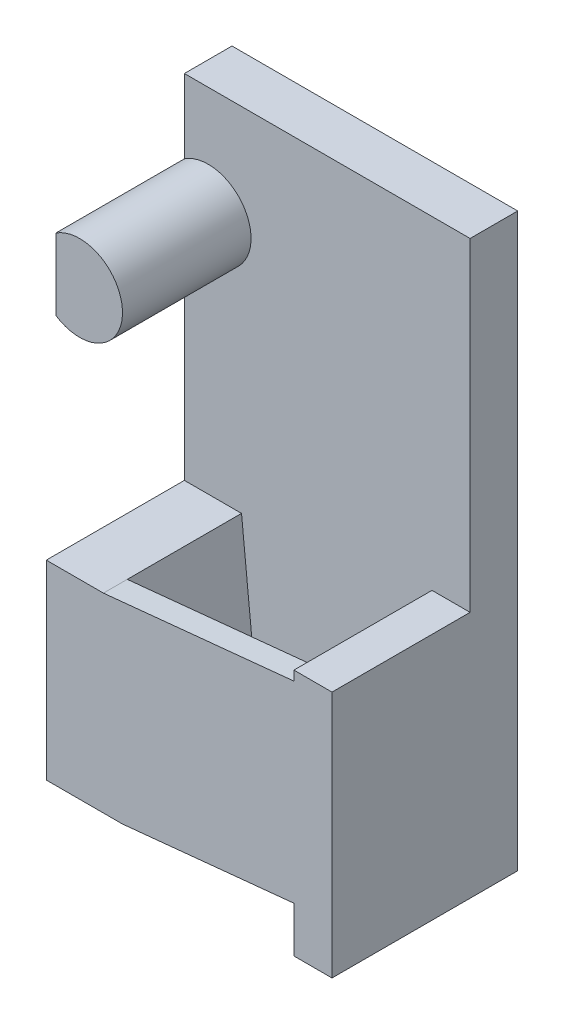
ISO-10303-21;
HEADER;
FILE_DESCRIPTION(('STEP AP214'),'2;1');
FILE_NAME('part.step','',(''),(''),'','','');
FILE_SCHEMA(('AUTOMOTIVE_DESIGN { 1 0 10303 214 1 1 1 1 }'));
ENDSEC;
DATA;
#1=APPLICATION_CONTEXT('core data for automotive mechanical design processes');
#2=APPLICATION_PROTOCOL_DEFINITION('international standard','automotive_design',2000,#1);
#3=PRODUCT_CONTEXT('',#1,'mechanical');
#4=PRODUCT('Part','Part','',(#3));
#5=PRODUCT_RELATED_PRODUCT_CATEGORY('part','',(#4));
#6=PRODUCT_DEFINITION_FORMATION('','',#4);
#7=PRODUCT_DEFINITION_CONTEXT('part definition',#1,'design');
#8=PRODUCT_DEFINITION('design','',#6,#7);
#9=PRODUCT_DEFINITION_SHAPE('','',#8);
#10=(LENGTH_UNIT() NAMED_UNIT(*) SI_UNIT(.MILLI.,.METRE.));
#11=(NAMED_UNIT(*) PLANE_ANGLE_UNIT() SI_UNIT($,.RADIAN.));
#12=(NAMED_UNIT(*) SI_UNIT($,.STERADIAN.) SOLID_ANGLE_UNIT());
#13=UNCERTAINTY_MEASURE_WITH_UNIT(LENGTH_MEASURE(1.E-05),#10,'distance_accuracy_value','');
#14=(GEOMETRIC_REPRESENTATION_CONTEXT(3) GLOBAL_UNCERTAINTY_ASSIGNED_CONTEXT((#13)) GLOBAL_UNIT_ASSIGNED_CONTEXT((#10,
#11,#12)) REPRESENTATION_CONTEXT('',''));
#15=CARTESIAN_POINT('',(0.,0.,0.));
#16=DIRECTION('',(0.,0.,1.));
#17=DIRECTION('',(1.,0.,0.));
#18=AXIS2_PLACEMENT_3D('',#15,#16,#17);
#19=CARTESIAN_POINT('',(52.,0.,39.));
#20=DIRECTION('',(1.,0.,0.));
#21=DIRECTION('',(0.,0.,-1.));
#22=AXIS2_PLACEMENT_3D('',#19,#20,#21);
#23=PLANE('',#22);
#24=DIRECTION('',(0.,0.,1.));
#25=VECTOR('',#24,1.);
#26=CARTESIAN_POINT('',(52.,9.6,39.));
#27=LINE('',#26,#25);
#28=CARTESIAN_POINT('',(52.,9.6,34.));
#29=VERTEX_POINT('',#28);
#30=CARTESIAN_POINT('',(52.,9.6,39.));
#31=VERTEX_POINT('',#30);
#32=EDGE_CURVE('E48',#29,#31,#27,.T.);
#33=ORIENTED_EDGE('',*,*,#32,.F.);
#34=DIRECTION('',(0.,-1.,0.));
#35=VECTOR('',#34,1.);
#36=CARTESIAN_POINT('',(52.,0.,34.));
#37=LINE('',#36,#35);
#38=CARTESIAN_POINT('',(52.,50.,34.));
#39=VERTEX_POINT('',#38);
#40=EDGE_CURVE('E184',#39,#29,#37,.T.);
#41=ORIENTED_EDGE('',*,*,#40,.F.);
#42=DIRECTION('',(0.,0.,-1.));
#43=VECTOR('',#42,1.);
#44=CARTESIAN_POINT('',(52.,50.,39.));
#45=LINE('',#44,#43);
#46=CARTESIAN_POINT('',(52.,50.,39.));
#47=VERTEX_POINT('',#46);
#48=EDGE_CURVE('E182',#47,#39,#45,.T.);
#49=ORIENTED_EDGE('',*,*,#48,.F.);
#50=DIRECTION('',(0.,-1.,0.));
#51=VECTOR('',#50,1.);
#52=CARTESIAN_POINT('',(52.,0.,39.));
#53=LINE('',#52,#51);
#54=CARTESIAN_POINT('',(52.,52.,39.));
#55=VERTEX_POINT('',#54);
#56=EDGE_CURVE('E162',#55,#47,#53,.T.);
#57=ORIENTED_EDGE('',*,*,#56,.F.);
#58=DIRECTION('',(0.,0.,-1.));
#59=VECTOR('',#58,1.);
#60=CARTESIAN_POINT('',(52.,52.,39.));
#61=LINE('',#60,#59);
#62=CARTESIAN_POINT('',(52.,52.,10.));
#63=VERTEX_POINT('',#62);
#64=EDGE_CURVE('E210',#55,#63,#61,.T.);
#65=ORIENTED_EDGE('',*,*,#64,.T.);
#66=DIRECTION('',(0.,-1.,0.));
#67=VECTOR('',#66,1.);
#68=CARTESIAN_POINT('',(52.,0.,10.));
#69=LINE('',#68,#67);
#70=CARTESIAN_POINT('',(52.,0.,10.));
#71=VERTEX_POINT('',#70);
#72=EDGE_CURVE('E197',#63,#71,#69,.T.);
#73=ORIENTED_EDGE('',*,*,#72,.T.);
#74=DIRECTION('',(0.,0.,-1.));
#75=VECTOR('',#74,1.);
#76=CARTESIAN_POINT('',(52.,0.,39.));
#77=LINE('',#76,#75);
#78=CARTESIAN_POINT('',(52.,0.,39.));
#79=VERTEX_POINT('',#78);
#80=EDGE_CURVE('E203',#79,#71,#77,.T.);
#81=ORIENTED_EDGE('',*,*,#80,.F.);
#82=EDGE_CURVE('E53',#31,#79,#53,.T.);
#83=ORIENTED_EDGE('',*,*,#82,.F.);
#84=EDGE_LOOP('',(#33,#41,#49,#57,#65,#73,#81,#83));
#85=FACE_BOUND('',#84,.T.);
#86=ADVANCED_FACE('F32',(#85),#23,.F.);
#87=CARTESIAN_POINT('',(12.,46.,10.));
#88=DIRECTION('',(-0.995037190209989,-0.0995037190209989,0.));
#89=DIRECTION('',(0.0995037190209989,-0.995037190209989,0.));
#90=AXIS2_PLACEMENT_3D('',#87,#88,#89);
#91=PLANE('',#90);
#92=DIRECTION('',(-0.099503719020999,0.995037190209989,0.));
#93=VECTOR('',#92,1.);
#94=CARTESIAN_POINT('',(12.,46.,34.));
#95=LINE('',#94,#93);
#96=CARTESIAN_POINT('',(16.,6.,34.));
#97=VERTEX_POINT('',#96);
#98=CARTESIAN_POINT('',(12.,46.,34.));
#99=VERTEX_POINT('',#98);
#100=EDGE_CURVE('E171',#97,#99,#95,.T.);
#101=ORIENTED_EDGE('',*,*,#100,.F.);
#102=DIRECTION('',(0.,0.,-1.));
#103=VECTOR('',#102,1.);
#104=CARTESIAN_POINT('',(16.,6.,39.));
#105=LINE('',#104,#103);
#106=CARTESIAN_POINT('',(16.,6.,10.));
#107=VERTEX_POINT('',#106);
#108=EDGE_CURVE('E220',#97,#107,#105,.T.);
#109=ORIENTED_EDGE('',*,*,#108,.T.);
#110=DIRECTION('',(0.0995037190209989,-0.995037190209989,0.));
#111=VECTOR('',#110,1.);
#112=CARTESIAN_POINT('',(12.,46.,10.));
#113=LINE('',#112,#111);
#114=CARTESIAN_POINT('',(12.,46.,10.));
#115=VERTEX_POINT('',#114);
#116=EDGE_CURVE('E187',#115,#107,#113,.T.);
#117=ORIENTED_EDGE('',*,*,#116,.F.);
#118=DIRECTION('',(0.,0.,1.));
#119=VECTOR('',#118,1.);
#120=CARTESIAN_POINT('',(12.,46.,10.));
#121=LINE('',#120,#119);
#122=EDGE_CURVE('E190',#115,#99,#121,.T.);
#123=ORIENTED_EDGE('',*,*,#122,.T.);
#124=EDGE_LOOP('',(#101,#109,#117,#123));
#125=FACE_BOUND('',#124,.T.);
#126=ADVANCED_FACE('F314',(#125),#91,.F.);
#127=CARTESIAN_POINT('',(0.,0.,10.));
#128=DIRECTION('',(0.,0.,-1.));
#129=DIRECTION('',(-1.,0.,0.));
#130=AXIS2_PLACEMENT_3D('',#127,#128,#129);
#131=PLANE('',#130);
#132=DIRECTION('',(-1.,0.,0.));
#133=VECTOR('',#132,1.);
#134=CARTESIAN_POINT('',(60.,52.,10.));
#135=LINE('',#134,#133);
#136=CARTESIAN_POINT('',(60.,52.,10.));
#137=VERTEX_POINT('',#136);
#138=EDGE_CURVE('E192',#137,#63,#135,.T.);
#139=ORIENTED_EDGE('',*,*,#138,.F.);
#140=DIRECTION('',(0.,1.,0.));
#141=VECTOR('',#140,1.);
#142=CARTESIAN_POINT('',(60.,0.,10.));
#143=LINE('',#142,#141);
#144=CARTESIAN_POINT('',(60.,120.,10.));
#145=VERTEX_POINT('',#144);
#146=EDGE_CURVE('E249',#137,#145,#143,.T.);
#147=ORIENTED_EDGE('',*,*,#146,.T.);
#148=DIRECTION('',(-1.,0.,0.));
#149=VECTOR('',#148,1.);
#150=CARTESIAN_POINT('',(0.,120.,10.));
#151=LINE('',#150,#149);
#152=CARTESIAN_POINT('',(0.,120.,10.));
#153=VERTEX_POINT('',#152);
#154=EDGE_CURVE('E251',#145,#153,#151,.T.);
#155=ORIENTED_EDGE('',*,*,#154,.T.);
#156=DIRECTION('',(0.,-1.,0.));
#157=VECTOR('',#156,1.);
#158=CARTESIAN_POINT('',(0.,0.,10.));
#159=LINE('',#158,#157);
#160=CARTESIAN_POINT('',(0.,104.483314773548,10.));
#161=VERTEX_POINT('',#160);
#162=EDGE_CURVE('E242',#153,#161,#159,.T.);
#163=ORIENTED_EDGE('',*,*,#162,.T.);
#164=CARTESIAN_POINT('',(5.,97.,10.));
#165=DIRECTION('',(0.,0.,1.));
#166=DIRECTION('',(1.,0.,0.));
#167=AXIS2_PLACEMENT_3D('',#164,#165,#166);
#168=CIRCLE('',#167,9.00000000000001);
#169=CARTESIAN_POINT('',(0.,89.5166852264521,10.));
#170=VERTEX_POINT('',#169);
#171=EDGE_CURVE('E11',#170,#161,#168,.T.);
#172=ORIENTED_EDGE('',*,*,#171,.F.);
#173=CARTESIAN_POINT('',(0.,46.,10.));
#174=VERTEX_POINT('',#173);
#175=EDGE_CURVE('E246',#170,#174,#159,.T.);
#176=ORIENTED_EDGE('',*,*,#175,.T.);
#177=DIRECTION('',(-1.,0.,0.));
#178=VECTOR('',#177,1.);
#179=CARTESIAN_POINT('',(16.,46.,10.));
#180=LINE('',#179,#178);
#181=EDGE_CURVE('E215',#115,#174,#180,.T.);
#182=ORIENTED_EDGE('',*,*,#181,.F.);
#183=ORIENTED_EDGE('',*,*,#116,.T.);
#184=DIRECTION('',(1.,0.,0.));
#185=VECTOR('',#184,1.);
#186=CARTESIAN_POINT('',(16.,6.,10.));
#187=LINE('',#186,#185);
#188=CARTESIAN_POINT('',(0.,6.,10.));
#189=VERTEX_POINT('',#188);
#190=EDGE_CURVE('E155',#189,#107,#187,.T.);
#191=ORIENTED_EDGE('',*,*,#190,.F.);
#192=CARTESIAN_POINT('',(0.,0.,10.));
#193=VERTEX_POINT('',#192);
#194=EDGE_CURVE('E247',#189,#193,#159,.T.);
#195=ORIENTED_EDGE('',*,*,#194,.T.);
#196=DIRECTION('',(1.,0.,0.));
#197=VECTOR('',#196,1.);
#198=CARTESIAN_POINT('',(0.,0.,10.));
#199=LINE('',#198,#197);
#200=EDGE_CURVE('E245',#193,#71,#199,.T.);
#201=ORIENTED_EDGE('',*,*,#200,.T.);
#202=ORIENTED_EDGE('',*,*,#72,.F.);
#203=EDGE_LOOP('',(#139,#147,#155,#163,#172,#176,#182,#183,#191,#195,#201,#202));
#204=FACE_BOUND('',#203,.T.);
#205=ADVANCED_FACE('F293',(#204),#131,.F.);
#206=CARTESIAN_POINT('',(0.,0.,10.));
#207=DIRECTION('',(1.,0.,0.));
#208=DIRECTION('',(0.,0.,-1.));
#209=AXIS2_PLACEMENT_3D('',#206,#207,#208);
#210=PLANE('',#209);
#211=ORIENTED_EDGE('',*,*,#175,.F.);
#212=DIRECTION('',(0.,0.,1.));
#213=VECTOR('',#212,1.);
#214=CARTESIAN_POINT('',(0.,89.5166852264521,0.));
#215=LINE('',#214,#213);
#216=CARTESIAN_POINT('',(0.,89.5166852264521,37.));
#217=VERTEX_POINT('',#216);
#218=EDGE_CURVE('E233',#170,#217,#215,.T.);
#219=ORIENTED_EDGE('',*,*,#218,.T.);
#220=DIRECTION('',(0.,1.,0.));
#221=VECTOR('',#220,1.);
#222=CARTESIAN_POINT('',(0.,104.483314773548,37.));
#223=LINE('',#222,#221);
#224=CARTESIAN_POINT('',(0.,104.483314773548,37.));
#225=VERTEX_POINT('',#224);
#226=EDGE_CURVE('E231',#217,#225,#223,.T.);
#227=ORIENTED_EDGE('',*,*,#226,.T.);
#228=DIRECTION('',(0.,0.,1.));
#229=VECTOR('',#228,1.);
#230=CARTESIAN_POINT('',(0.,104.483314773548,0.));
#231=LINE('',#230,#229);
#232=EDGE_CURVE('E234',#161,#225,#231,.T.);
#233=ORIENTED_EDGE('',*,*,#232,.F.);
#234=ORIENTED_EDGE('',*,*,#162,.F.);
#235=DIRECTION('',(0.,0.,-1.));
#236=VECTOR('',#235,1.);
#237=CARTESIAN_POINT('',(0.,120.,10.));
#238=LINE('',#237,#236);
#239=CARTESIAN_POINT('',(0.,120.,0.));
#240=VERTEX_POINT('',#239);
#241=EDGE_CURVE('E253',#153,#240,#238,.T.);
#242=ORIENTED_EDGE('',*,*,#241,.T.);
#243=DIRECTION('',(0.,-1.,0.));
#244=VECTOR('',#243,1.);
#245=CARTESIAN_POINT('',(0.,0.,0.));
#246=LINE('',#245,#244);
#247=CARTESIAN_POINT('',(0.,0.,0.));
#248=VERTEX_POINT('',#247);
#249=EDGE_CURVE('E240',#240,#248,#246,.T.);
#250=ORIENTED_EDGE('',*,*,#249,.T.);
#251=DIRECTION('',(0.,0.,-1.));
#252=VECTOR('',#251,1.);
#253=CARTESIAN_POINT('',(0.,0.,10.));
#254=LINE('',#253,#252);
#255=EDGE_CURVE('E36',#193,#248,#254,.T.);
#256=ORIENTED_EDGE('',*,*,#255,.F.);
#257=ORIENTED_EDGE('',*,*,#194,.F.);
#258=DIRECTION('',(0.,0.,-1.));
#259=VECTOR('',#258,1.);
#260=CARTESIAN_POINT('',(0.,6.,39.));
#261=LINE('',#260,#259);
#262=CARTESIAN_POINT('',(0.,6.,39.));
#263=VERTEX_POINT('',#262);
#264=EDGE_CURVE('E227',#263,#189,#261,.T.);
#265=ORIENTED_EDGE('',*,*,#264,.F.);
#266=DIRECTION('',(0.,-1.,0.));
#267=VECTOR('',#266,1.);
#268=CARTESIAN_POINT('',(0.,6.,39.));
#269=LINE('',#268,#267);
#270=CARTESIAN_POINT('',(0.,46.,39.));
#271=VERTEX_POINT('',#270);
#272=EDGE_CURVE('E154',#271,#263,#269,.T.);
#273=ORIENTED_EDGE('',*,*,#272,.F.);
#274=DIRECTION('',(0.,0.,-1.));
#275=VECTOR('',#274,1.);
#276=CARTESIAN_POINT('',(0.,46.,39.));
#277=LINE('',#276,#275);
#278=EDGE_CURVE('E151',#271,#174,#277,.T.);
#279=ORIENTED_EDGE('',*,*,#278,.T.);
#280=EDGE_LOOP('',(#211,#219,#227,#233,#234,#242,#250,#256,#257,#265,#273,#279));
#281=FACE_BOUND('',#280,.T.);
#282=ADVANCED_FACE('F34',(#281),#210,.F.);
#283=CARTESIAN_POINT('',(0.,0.,10.));
#284=DIRECTION('',(0.,1.,0.));
#285=DIRECTION('',(0.,0.,1.));
#286=AXIS2_PLACEMENT_3D('',#283,#284,#285);
#287=PLANE('',#286);
#288=DIRECTION('',(1.,0.,0.));
#289=VECTOR('',#288,1.);
#290=CARTESIAN_POINT('',(0.,0.,0.));
#291=LINE('',#290,#289);
#292=CARTESIAN_POINT('',(60.,0.,0.));
#293=VERTEX_POINT('',#292);
#294=EDGE_CURVE('E255',#248,#293,#291,.T.);
#295=ORIENTED_EDGE('',*,*,#294,.T.);
#296=DIRECTION('',(0.,0.,-1.));
#297=VECTOR('',#296,1.);
#298=CARTESIAN_POINT('',(60.,0.,10.));
#299=LINE('',#298,#297);
#300=CARTESIAN_POINT('',(60.,0.,39.));
#301=VERTEX_POINT('',#300);
#302=EDGE_CURVE('E265',#301,#293,#299,.T.);
#303=ORIENTED_EDGE('',*,*,#302,.F.);
#304=DIRECTION('',(1.,0.,0.));
#305=VECTOR('',#304,1.);
#306=CARTESIAN_POINT('',(60.,0.,39.));
#307=LINE('',#306,#305);
#308=EDGE_CURVE('E200',#79,#301,#307,.T.);
#309=ORIENTED_EDGE('',*,*,#308,.F.);
#310=ORIENTED_EDGE('',*,*,#80,.T.);
#311=ORIENTED_EDGE('',*,*,#200,.F.);
#312=ORIENTED_EDGE('',*,*,#255,.T.);
#313=EDGE_LOOP('',(#295,#303,#309,#310,#311,#312));
#314=FACE_BOUND('',#313,.T.);
#315=ADVANCED_FACE('F274',(#314),#287,.F.);
#316=CARTESIAN_POINT('',(60.,0.,10.));
#317=DIRECTION('',(-1.,0.,0.));
#318=DIRECTION('',(0.,0.,1.));
#319=AXIS2_PLACEMENT_3D('',#316,#317,#318);
#320=PLANE('',#319);
#321=DIRECTION('',(0.,1.,0.));
#322=VECTOR('',#321,1.);
#323=CARTESIAN_POINT('',(60.,0.,0.));
#324=LINE('',#323,#322);
#325=CARTESIAN_POINT('',(60.,120.,0.));
#326=VERTEX_POINT('',#325);
#327=EDGE_CURVE('E257',#293,#326,#324,.T.);
#328=ORIENTED_EDGE('',*,*,#327,.T.);
#329=DIRECTION('',(0.,0.,-1.));
#330=VECTOR('',#329,1.);
#331=CARTESIAN_POINT('',(60.,120.,10.));
#332=LINE('',#331,#330);
#333=EDGE_CURVE('E263',#145,#326,#332,.T.);
#334=ORIENTED_EDGE('',*,*,#333,.F.);
#335=ORIENTED_EDGE('',*,*,#146,.F.);
#336=DIRECTION('',(0.,0.,-1.));
#337=VECTOR('',#336,1.);
#338=CARTESIAN_POINT('',(60.,52.,39.));
#339=LINE('',#338,#337);
#340=CARTESIAN_POINT('',(60.,52.,39.));
#341=VERTEX_POINT('',#340);
#342=EDGE_CURVE('E213',#341,#137,#339,.T.);
#343=ORIENTED_EDGE('',*,*,#342,.F.);
#344=DIRECTION('',(0.,1.,0.));
#345=VECTOR('',#344,1.);
#346=CARTESIAN_POINT('',(60.,0.,39.));
#347=LINE('',#346,#345);
#348=EDGE_CURVE('E193',#301,#341,#347,.T.);
#349=ORIENTED_EDGE('',*,*,#348,.F.);
#350=ORIENTED_EDGE('',*,*,#302,.T.);
#351=EDGE_LOOP('',(#328,#334,#335,#343,#349,#350));
#352=FACE_BOUND('',#351,.T.);
#353=ADVANCED_FACE('F287',(#352),#320,.F.);
#354=CARTESIAN_POINT('',(0.,120.,10.));
#355=DIRECTION('',(0.,-1.,0.));
#356=DIRECTION('',(0.,0.,-1.));
#357=AXIS2_PLACEMENT_3D('',#354,#355,#356);
#358=PLANE('',#357);
#359=DIRECTION('',(-1.,0.,0.));
#360=VECTOR('',#359,1.);
#361=CARTESIAN_POINT('',(0.,120.,0.));
#362=LINE('',#361,#360);
#363=EDGE_CURVE('E259',#326,#240,#362,.T.);
#364=ORIENTED_EDGE('',*,*,#363,.T.);
#365=ORIENTED_EDGE('',*,*,#241,.F.);
#366=ORIENTED_EDGE('',*,*,#154,.F.);
#367=ORIENTED_EDGE('',*,*,#333,.T.);
#368=EDGE_LOOP('',(#364,#365,#366,#367));
#369=FACE_BOUND('',#368,.T.);
#370=ADVANCED_FACE('F290',(#369),#358,.F.);
#371=CARTESIAN_POINT('',(0.,0.,0.));
#372=DIRECTION('',(0.,0.,-1.));
#373=DIRECTION('',(-1.,0.,0.));
#374=AXIS2_PLACEMENT_3D('',#371,#372,#373);
#375=PLANE('',#374);
#376=ORIENTED_EDGE('',*,*,#249,.F.);
#377=ORIENTED_EDGE('',*,*,#363,.F.);
#378=ORIENTED_EDGE('',*,*,#327,.F.);
#379=ORIENTED_EDGE('',*,*,#294,.F.);
#380=EDGE_LOOP('',(#376,#377,#378,#379));
#381=FACE_BOUND('',#380,.T.);
#382=ADVANCED_FACE('F285',(#381),#375,.T.);
#383=CARTESIAN_POINT('',(5.,97.,37.));
#384=DIRECTION('',(0.,0.,-1.));
#385=DIRECTION('',(-1.,0.,0.));
#386=AXIS2_PLACEMENT_3D('',#383,#384,#385);
#387=CYLINDRICAL_SURFACE('',#386,9.00000000000001);
#388=ORIENTED_EDGE('',*,*,#171,.T.);
#389=ORIENTED_EDGE('',*,*,#232,.T.);
#390=CARTESIAN_POINT('',(5.,97.,37.));
#391=DIRECTION('',(0.,0.,1.));
#392=DIRECTION('',(1.,0.,0.));
#393=AXIS2_PLACEMENT_3D('',#390,#391,#392);
#394=CIRCLE('',#393,9.00000000000001);
#395=EDGE_CURVE('E237',#217,#225,#394,.T.);
#396=ORIENTED_EDGE('',*,*,#395,.F.);
#397=ORIENTED_EDGE('',*,*,#218,.F.);
#398=EDGE_LOOP('',(#388,#389,#396,#397));
#399=FACE_BOUND('',#398,.T.);
#400=ADVANCED_FACE('F337',(#399),#387,.T.);
#401=CARTESIAN_POINT('',(5.,97.,37.));
#402=DIRECTION('',(0.,0.,1.));
#403=DIRECTION('',(1.,0.,0.));
#404=AXIS2_PLACEMENT_3D('',#401,#402,#403);
#405=PLANE('',#404);
#406=ORIENTED_EDGE('',*,*,#226,.F.);
#407=ORIENTED_EDGE('',*,*,#395,.T.);
#408=EDGE_LOOP('',(#406,#407));
#409=FACE_BOUND('',#408,.T.);
#410=ADVANCED_FACE('F334',(#409),#405,.T.);
#411=CARTESIAN_POINT('',(16.,46.,39.));
#412=DIRECTION('',(0.,-1.,0.));
#413=DIRECTION('',(0.,0.,-1.));
#414=AXIS2_PLACEMENT_3D('',#411,#412,#413);
#415=PLANE('',#414);
#416=DIRECTION('',(-1.,0.,0.));
#417=VECTOR('',#416,1.);
#418=CARTESIAN_POINT('',(16.,46.,39.));
#419=LINE('',#418,#417);
#420=CARTESIAN_POINT('',(12.,46.,39.));
#421=VERTEX_POINT('',#420);
#422=EDGE_CURVE('E143',#421,#271,#419,.T.);
#423=ORIENTED_EDGE('',*,*,#422,.F.);
#424=DIRECTION('',(0.,0.,1.));
#425=VECTOR('',#424,1.);
#426=CARTESIAN_POINT('',(12.,46.,39.));
#427=LINE('',#426,#425);
#428=EDGE_CURVE('E148',#99,#421,#427,.T.);
#429=ORIENTED_EDGE('',*,*,#428,.F.);
#430=ORIENTED_EDGE('',*,*,#122,.F.);
#431=ORIENTED_EDGE('',*,*,#181,.T.);
#432=ORIENTED_EDGE('',*,*,#278,.F.);
#433=EDGE_LOOP('',(#423,#429,#430,#431,#432));
#434=FACE_BOUND('',#433,.T.);
#435=ADVANCED_FACE('F145',(#434),#415,.F.);
#436=CARTESIAN_POINT('',(16.,6.,39.));
#437=DIRECTION('',(0.,1.,0.));
#438=DIRECTION('',(0.,0.,1.));
#439=AXIS2_PLACEMENT_3D('',#436,#437,#438);
#440=PLANE('',#439);
#441=ORIENTED_EDGE('',*,*,#190,.T.);
#442=ORIENTED_EDGE('',*,*,#108,.F.);
#443=CARTESIAN_POINT('',(16.,6.,39.));
#444=VERTEX_POINT('',#443);
#445=EDGE_CURVE('E224',#444,#97,#105,.T.);
#446=ORIENTED_EDGE('',*,*,#445,.F.);
#447=DIRECTION('',(1.,0.,0.));
#448=VECTOR('',#447,1.);
#449=CARTESIAN_POINT('',(16.,6.,39.));
#450=LINE('',#449,#448);
#451=EDGE_CURVE('E218',#263,#444,#450,.T.);
#452=ORIENTED_EDGE('',*,*,#451,.F.);
#453=ORIENTED_EDGE('',*,*,#264,.T.);
#454=EDGE_LOOP('',(#441,#442,#446,#452,#453));
#455=FACE_BOUND('',#454,.T.);
#456=ADVANCED_FACE('F307',(#455),#440,.F.);
#457=CARTESIAN_POINT('',(0.,0.,39.));
#458=DIRECTION('',(0.,0.,1.));
#459=DIRECTION('',(1.,0.,0.));
#460=AXIS2_PLACEMENT_3D('',#457,#458,#459);
#461=PLANE('',#460);
#462=ORIENTED_EDGE('',*,*,#451,.T.);
#463=DIRECTION('',(-0.995037190209989,-0.0995037190209989,0.));
#464=VECTOR('',#463,1.);
#465=CARTESIAN_POINT('',(57.7915619888196,10.179156198882,39.));
#466=LINE('',#465,#464);
#467=EDGE_CURVE('E179',#31,#444,#466,.T.);
#468=ORIENTED_EDGE('',*,*,#467,.F.);
#469=ORIENTED_EDGE('',*,*,#82,.T.);
#470=ORIENTED_EDGE('',*,*,#308,.T.);
#471=ORIENTED_EDGE('',*,*,#348,.T.);
#472=DIRECTION('',(-1.,0.,0.));
#473=VECTOR('',#472,1.);
#474=CARTESIAN_POINT('',(60.,52.,39.));
#475=LINE('',#474,#473);
#476=EDGE_CURVE('E196',#341,#55,#475,.T.);
#477=ORIENTED_EDGE('',*,*,#476,.T.);
#478=ORIENTED_EDGE('',*,*,#56,.T.);
#479=DIRECTION('',(-0.995037190209989,-0.0995037190209989,0.));
#480=VECTOR('',#479,1.);
#481=CARTESIAN_POINT('',(53.7915619888196,50.179156198882,39.));
#482=LINE('',#481,#480);
#483=EDGE_CURVE('E159',#47,#421,#482,.T.);
#484=ORIENTED_EDGE('',*,*,#483,.T.);
#485=ORIENTED_EDGE('',*,*,#422,.T.);
#486=ORIENTED_EDGE('',*,*,#272,.T.);
#487=EDGE_LOOP('',(#462,#468,#469,#470,#471,#477,#478,#484,#485,#486));
#488=FACE_BOUND('',#487,.T.);
#489=ADVANCED_FACE('F160',(#488),#461,.T.);
#490=CARTESIAN_POINT('',(60.,52.,39.));
#491=DIRECTION('',(0.,-1.,0.));
#492=DIRECTION('',(0.,0.,-1.));
#493=AXIS2_PLACEMENT_3D('',#490,#491,#492);
#494=PLANE('',#493);
#495=ORIENTED_EDGE('',*,*,#138,.T.);
#496=ORIENTED_EDGE('',*,*,#64,.F.);
#497=ORIENTED_EDGE('',*,*,#476,.F.);
#498=ORIENTED_EDGE('',*,*,#342,.T.);
#499=EDGE_LOOP('',(#495,#496,#497,#498));
#500=FACE_BOUND('',#499,.T.);
#501=ADVANCED_FACE('F297',(#500),#494,.F.);
#502=CARTESIAN_POINT('',(57.7915619888196,10.179156198882,39.));
#503=DIRECTION('',(-0.0995037190209989,0.995037190209989,0.));
#504=DIRECTION('',(-0.995037190209989,-0.099503719020999,0.));
#505=AXIS2_PLACEMENT_3D('',#502,#503,#504);
#506=PLANE('',#505);
#507=DIRECTION('',(-0.995037190209989,-0.0995037190209989,0.));
#508=VECTOR('',#507,1.);
#509=CARTESIAN_POINT('',(57.7915619888196,10.179156198882,34.));
#510=LINE('',#509,#508);
#511=EDGE_CURVE('E176',#29,#97,#510,.T.);
#512=ORIENTED_EDGE('',*,*,#511,.F.);
#513=ORIENTED_EDGE('',*,*,#32,.T.);
#514=ORIENTED_EDGE('',*,*,#467,.T.);
#515=ORIENTED_EDGE('',*,*,#445,.T.);
#516=EDGE_LOOP('',(#512,#513,#514,#515));
#517=FACE_BOUND('',#516,.T.);
#518=ADVANCED_FACE('F310',(#517),#506,.F.);
#519=CARTESIAN_POINT('',(53.7915619888196,50.179156198882,34.));
#520=DIRECTION('',(0.,0.,1.));
#521=DIRECTION('',(0.,-1.,0.));
#522=AXIS2_PLACEMENT_3D('',#519,#520,#521);
#523=PLANE('',#522);
#524=DIRECTION('',(-0.995037190209989,-0.0995037190209989,0.));
#525=VECTOR('',#524,1.);
#526=CARTESIAN_POINT('',(53.7915619888196,50.179156198882,34.));
#527=LINE('',#526,#525);
#528=EDGE_CURVE('E165',#39,#99,#527,.T.);
#529=ORIENTED_EDGE('',*,*,#528,.F.);
#530=ORIENTED_EDGE('',*,*,#40,.T.);
#531=ORIENTED_EDGE('',*,*,#511,.T.);
#532=ORIENTED_EDGE('',*,*,#100,.T.);
#533=EDGE_LOOP('',(#529,#530,#531,#532));
#534=FACE_BOUND('',#533,.T.);
#535=ADVANCED_FACE('F312',(#534),#523,.F.);
#536=CARTESIAN_POINT('',(53.7915619888196,50.179156198882,39.));
#537=DIRECTION('',(0.0995037190209989,-0.995037190209989,0.));
#538=DIRECTION('',(0.995037190209989,0.099503719020999,0.));
#539=AXIS2_PLACEMENT_3D('',#536,#537,#538);
#540=PLANE('',#539);
#541=ORIENTED_EDGE('',*,*,#483,.F.);
#542=ORIENTED_EDGE('',*,*,#48,.T.);
#543=ORIENTED_EDGE('',*,*,#528,.T.);
#544=ORIENTED_EDGE('',*,*,#428,.T.);
#545=EDGE_LOOP('',(#541,#542,#543,#544));
#546=FACE_BOUND('',#545,.T.);
#547=ADVANCED_FACE('F168',(#546),#540,.F.);
#548=CLOSED_SHELL('',(#86,#126,#205,#282,#315,#353,#370,#382,#400,#410,#435,#456,#489,#501,#518,
#535,#547));
#549=MANIFOLD_SOLID_BREP('B2',#548);
#550=ADVANCED_BREP_SHAPE_REPRESENTATION('',(#18,#549),#14);
#551=SHAPE_DEFINITION_REPRESENTATION(#9,#550);
ENDSEC;
END-ISO-10303-21;
